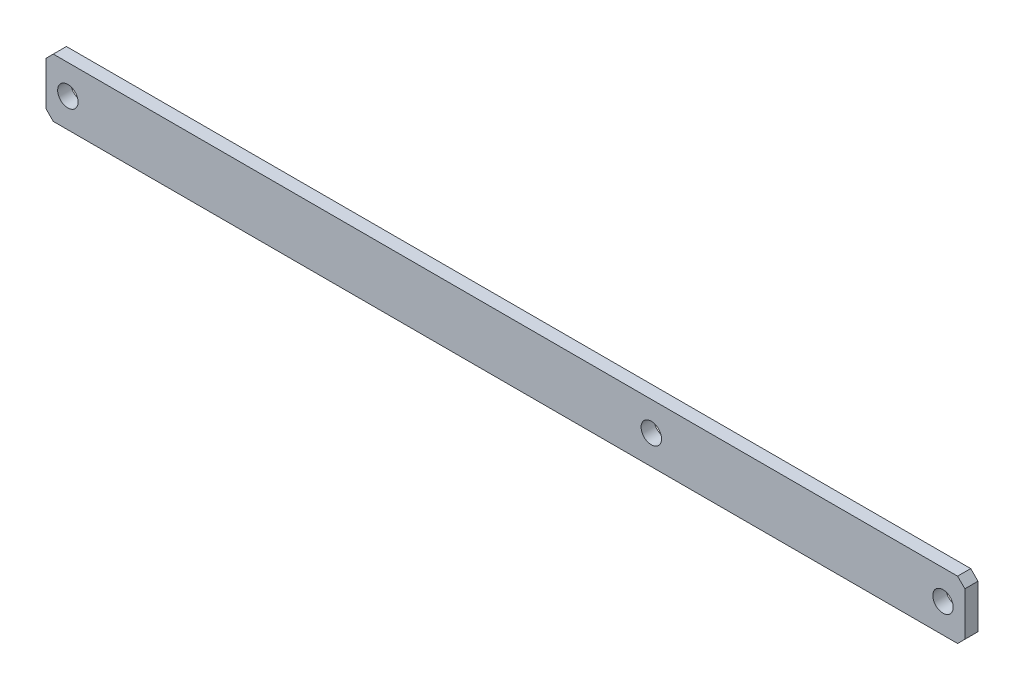
ISO-10303-21;
HEADER;
FILE_DESCRIPTION(('STEP AP214'),'2;1');
FILE_NAME('part.step','',(''),(''),'','','');
FILE_SCHEMA(('AUTOMOTIVE_DESIGN { 1 0 10303 214 1 1 1 1 }'));
ENDSEC;
DATA;
#1=APPLICATION_CONTEXT('core data for automotive mechanical design processes');
#2=APPLICATION_PROTOCOL_DEFINITION('international standard','automotive_design',2000,#1);
#3=PRODUCT_CONTEXT('',#1,'mechanical');
#4=PRODUCT('Part','Part','',(#3));
#5=PRODUCT_RELATED_PRODUCT_CATEGORY('part','',(#4));
#6=PRODUCT_DEFINITION_FORMATION('','',#4);
#7=PRODUCT_DEFINITION_CONTEXT('part definition',#1,'design');
#8=PRODUCT_DEFINITION('design','',#6,#7);
#9=PRODUCT_DEFINITION_SHAPE('','',#8);
#10=(LENGTH_UNIT() NAMED_UNIT(*) SI_UNIT(.MILLI.,.METRE.));
#11=(NAMED_UNIT(*) PLANE_ANGLE_UNIT() SI_UNIT($,.RADIAN.));
#12=(NAMED_UNIT(*) SI_UNIT($,.STERADIAN.) SOLID_ANGLE_UNIT());
#13=UNCERTAINTY_MEASURE_WITH_UNIT(LENGTH_MEASURE(1.E-05),#10,'distance_accuracy_value','');
#14=(GEOMETRIC_REPRESENTATION_CONTEXT(3) GLOBAL_UNCERTAINTY_ASSIGNED_CONTEXT((#13)) GLOBAL_UNIT_ASSIGNED_CONTEXT((#10,
#11,#12)) REPRESENTATION_CONTEXT('',''));
#15=CARTESIAN_POINT('',(0.,0.,0.));
#16=DIRECTION('',(0.,0.,1.));
#17=DIRECTION('',(1.,0.,0.));
#18=AXIS2_PLACEMENT_3D('',#15,#16,#17);
#19=CARTESIAN_POINT('',(0.,0.,9.));
#20=DIRECTION('',(0.,0.,-1.));
#21=DIRECTION('',(-1.,0.,0.));
#22=AXIS2_PLACEMENT_3D('',#19,#20,#21);
#23=PLANE('',#22);
#24=CARTESIAN_POINT('',(200.,0.,9.));
#25=DIRECTION('',(0.,0.,-1.));
#26=DIRECTION('',(-1.,0.,0.));
#27=AXIS2_PLACEMENT_3D('',#24,#25,#26);
#28=CIRCLE('',#27,7.00000000000001);
#29=CARTESIAN_POINT('',(193.,0.,9.));
#30=VERTEX_POINT('',#29);
#31=EDGE_CURVE('E112',#30,#30,#28,.T.);
#32=ORIENTED_EDGE('',*,*,#31,.T.);
#33=EDGE_LOOP('',(#32));
#34=FACE_BOUND('',#33,.T.);
#35=CARTESIAN_POINT('',(0.,0.,9.));
#36=DIRECTION('',(0.,0.,-1.));
#37=DIRECTION('',(-1.,0.,0.));
#38=AXIS2_PLACEMENT_3D('',#35,#36,#37);
#39=CIRCLE('',#38,7.);
#40=CARTESIAN_POINT('',(-7.,0.,9.));
#41=VERTEX_POINT('',#40);
#42=EDGE_CURVE('E18',#41,#41,#39,.T.);
#43=ORIENTED_EDGE('',*,*,#42,.T.);
#44=EDGE_LOOP('',(#43));
#45=FACE_BOUND('',#44,.T.);
#46=CARTESIAN_POINT('',(-400.,0.,9.));
#47=DIRECTION('',(0.,0.,-1.));
#48=DIRECTION('',(-1.,0.,0.));
#49=AXIS2_PLACEMENT_3D('',#46,#47,#48);
#50=CIRCLE('',#49,7.00000000000001);
#51=CARTESIAN_POINT('',(-407.,0.,9.));
#52=VERTEX_POINT('',#51);
#53=EDGE_CURVE('E114',#52,#52,#50,.T.);
#54=ORIENTED_EDGE('',*,*,#53,.T.);
#55=EDGE_LOOP('',(#54));
#56=FACE_BOUND('',#55,.T.);
#57=DIRECTION('',(0.,1.,0.));
#58=VECTOR('',#57,1.);
#59=CARTESIAN_POINT('',(-415.,-15.,9.));
#60=LINE('',#59,#58);
#61=CARTESIAN_POINT('',(-415.,15.,9.));
#62=VERTEX_POINT('',#61);
#63=CARTESIAN_POINT('',(-415.,-15.,9.));
#64=VERTEX_POINT('',#63);
#65=EDGE_CURVE('E118',#62,#64,#60,.F.);
#66=ORIENTED_EDGE('',*,*,#65,.T.);
#67=DIRECTION('',(-0.707106781186552,0.707106781186543,0.));
#68=VECTOR('',#67,1.);
#69=CARTESIAN_POINT('',(-415.,-15.,9.));
#70=LINE('',#69,#68);
#71=CARTESIAN_POINT('',(-410.,-20.,9.));
#72=VERTEX_POINT('',#71);
#73=EDGE_CURVE('E127',#64,#72,#70,.F.);
#74=ORIENTED_EDGE('',*,*,#73,.T.);
#75=DIRECTION('',(1.,0.,0.));
#76=VECTOR('',#75,1.);
#77=CARTESIAN_POINT('',(0.,-20.,9.));
#78=LINE('',#77,#76);
#79=CARTESIAN_POINT('',(210.,-20.,9.));
#80=VERTEX_POINT('',#79);
#81=EDGE_CURVE('E131',#72,#80,#78,.T.);
#82=ORIENTED_EDGE('',*,*,#81,.T.);
#83=DIRECTION('',(-0.707106781186544,-0.707106781186551,0.));
#84=VECTOR('',#83,1.);
#85=CARTESIAN_POINT('',(210.,-20.,9.));
#86=LINE('',#85,#84);
#87=CARTESIAN_POINT('',(215.,-15.,9.));
#88=VERTEX_POINT('',#87);
#89=EDGE_CURVE('E135',#80,#88,#86,.F.);
#90=ORIENTED_EDGE('',*,*,#89,.T.);
#91=DIRECTION('',(0.,1.,0.));
#92=VECTOR('',#91,1.);
#93=CARTESIAN_POINT('',(215.,15.,9.));
#94=LINE('',#93,#92);
#95=CARTESIAN_POINT('',(215.,15.,9.));
#96=VERTEX_POINT('',#95);
#97=EDGE_CURVE('E139',#88,#96,#94,.T.);
#98=ORIENTED_EDGE('',*,*,#97,.T.);
#99=DIRECTION('',(0.707106781186544,-0.707106781186551,0.));
#100=VECTOR('',#99,1.);
#101=CARTESIAN_POINT('',(210.,20.,9.));
#102=LINE('',#101,#100);
#103=CARTESIAN_POINT('',(210.,20.,9.));
#104=VERTEX_POINT('',#103);
#105=EDGE_CURVE('E78',#96,#104,#102,.F.);
#106=ORIENTED_EDGE('',*,*,#105,.T.);
#107=DIRECTION('',(1.,0.,0.));
#108=VECTOR('',#107,1.);
#109=CARTESIAN_POINT('',(-410.,20.,9.));
#110=LINE('',#109,#108);
#111=CARTESIAN_POINT('',(-410.,20.,9.));
#112=VERTEX_POINT('',#111);
#113=EDGE_CURVE('E80',#104,#112,#110,.F.);
#114=ORIENTED_EDGE('',*,*,#113,.T.);
#115=DIRECTION('',(0.707106781186552,0.707106781186543,0.));
#116=VECTOR('',#115,1.);
#117=CARTESIAN_POINT('',(-415.,15.,9.));
#118=LINE('',#117,#116);
#119=EDGE_CURVE('E82',#112,#62,#118,.F.);
#120=ORIENTED_EDGE('',*,*,#119,.T.);
#121=EDGE_LOOP('',(#66,#74,#82,#90,#98,#106,#114,#120));
#122=FACE_BOUND('',#121,.T.);
#123=ADVANCED_FACE('F15',(#34,#45,#56,#122),#23,.F.);
#124=CARTESIAN_POINT('',(0.,0.,9.));
#125=DIRECTION('',(0.,0.,-1.));
#126=DIRECTION('',(-1.,0.,0.));
#127=AXIS2_PLACEMENT_3D('',#124,#125,#126);
#128=CYLINDRICAL_SURFACE('',#127,7.);
#129=ORIENTED_EDGE('',*,*,#42,.F.);
#130=EDGE_LOOP('',(#129));
#131=FACE_BOUND('',#130,.T.);
#132=CARTESIAN_POINT('',(0.,0.,0.));
#133=DIRECTION('',(0.,0.,-1.));
#134=DIRECTION('',(-1.,0.,0.));
#135=AXIS2_PLACEMENT_3D('',#132,#133,#134);
#136=CIRCLE('',#135,7.);
#137=CARTESIAN_POINT('',(-7.,0.,0.));
#138=VERTEX_POINT('',#137);
#139=EDGE_CURVE('E108',#138,#138,#136,.F.);
#140=ORIENTED_EDGE('',*,*,#139,.F.);
#141=EDGE_LOOP('',(#140));
#142=FACE_BOUND('',#141,.T.);
#143=ADVANCED_FACE('F280',(#131,#142),#128,.F.);
#144=CARTESIAN_POINT('',(-415.,15.,9.));
#145=DIRECTION('',(0.707106781186543,-0.707106781186552,0.));
#146=DIRECTION('',(0.707106781186552,0.707106781186543,0.));
#147=AXIS2_PLACEMENT_3D('',#144,#145,#146);
#148=PLANE('',#147);
#149=DIRECTION('',(0.,0.,-1.));
#150=VECTOR('',#149,1.);
#151=CARTESIAN_POINT('',(-415.,15.,9.));
#152=LINE('',#151,#150);
#153=CARTESIAN_POINT('',(-415.,15.,0.));
#154=VERTEX_POINT('',#153);
#155=EDGE_CURVE('E93',#154,#62,#152,.F.);
#156=ORIENTED_EDGE('',*,*,#155,.T.);
#157=ORIENTED_EDGE('',*,*,#119,.F.);
#158=DIRECTION('',(0.,0.,-1.));
#159=VECTOR('',#158,1.);
#160=CARTESIAN_POINT('',(-410.,20.,9.));
#161=LINE('',#160,#159);
#162=CARTESIAN_POINT('',(-410.,20.,0.));
#163=VERTEX_POINT('',#162);
#164=EDGE_CURVE('E87',#112,#163,#161,.T.);
#165=ORIENTED_EDGE('',*,*,#164,.T.);
#166=DIRECTION('',(0.707106781186552,0.707106781186543,0.));
#167=VECTOR('',#166,1.);
#168=CARTESIAN_POINT('',(-415.,15.,0.));
#169=LINE('',#168,#167);
#170=EDGE_CURVE('E111',#154,#163,#169,.T.);
#171=ORIENTED_EDGE('',*,*,#170,.F.);
#172=EDGE_LOOP('',(#156,#157,#165,#171));
#173=FACE_BOUND('',#172,.T.);
#174=ADVANCED_FACE('F90',(#173),#148,.F.);
#175=CARTESIAN_POINT('',(-410.,20.,9.));
#176=DIRECTION('',(0.,-1.,0.));
#177=DIRECTION('',(0.,0.,-1.));
#178=AXIS2_PLACEMENT_3D('',#175,#176,#177);
#179=PLANE('',#178);
#180=ORIENTED_EDGE('',*,*,#164,.F.);
#181=ORIENTED_EDGE('',*,*,#113,.F.);
#182=DIRECTION('',(0.,0.,1.));
#183=VECTOR('',#182,1.);
#184=CARTESIAN_POINT('',(210.,20.,9.));
#185=LINE('',#184,#183);
#186=CARTESIAN_POINT('',(210.,20.,0.));
#187=VERTEX_POINT('',#186);
#188=EDGE_CURVE('E101',#104,#187,#185,.F.);
#189=ORIENTED_EDGE('',*,*,#188,.T.);
#190=DIRECTION('',(-1.,0.,0.));
#191=VECTOR('',#190,1.);
#192=CARTESIAN_POINT('',(0.,20.,0.));
#193=LINE('',#192,#191);
#194=EDGE_CURVE('E98',#163,#187,#193,.F.);
#195=ORIENTED_EDGE('',*,*,#194,.F.);
#196=EDGE_LOOP('',(#180,#181,#189,#195));
#197=FACE_BOUND('',#196,.T.);
#198=ADVANCED_FACE('F96',(#197),#179,.F.);
#199=CARTESIAN_POINT('',(210.,20.,9.));
#200=DIRECTION('',(-0.707106781186551,-0.707106781186544,0.));
#201=DIRECTION('',(0.707106781186544,-0.707106781186551,0.));
#202=AXIS2_PLACEMENT_3D('',#199,#200,#201);
#203=PLANE('',#202);
#204=ORIENTED_EDGE('',*,*,#188,.F.);
#205=ORIENTED_EDGE('',*,*,#105,.F.);
#206=DIRECTION('',(0.,0.,1.));
#207=VECTOR('',#206,1.);
#208=CARTESIAN_POINT('',(215.,15.,9.));
#209=LINE('',#208,#207);
#210=CARTESIAN_POINT('',(215.,15.,0.));
#211=VERTEX_POINT('',#210);
#212=EDGE_CURVE('E137',#96,#211,#209,.F.);
#213=ORIENTED_EDGE('',*,*,#212,.T.);
#214=DIRECTION('',(0.707106781186542,-0.707106781186553,0.));
#215=VECTOR('',#214,1.);
#216=CARTESIAN_POINT('',(210.,20.,0.));
#217=LINE('',#216,#215);
#218=EDGE_CURVE('E143',#187,#211,#217,.T.);
#219=ORIENTED_EDGE('',*,*,#218,.F.);
#220=EDGE_LOOP('',(#204,#205,#213,#219));
#221=FACE_BOUND('',#220,.T.);
#222=ADVANCED_FACE('F144',(#221),#203,.F.);
#223=CARTESIAN_POINT('',(215.,15.,9.));
#224=DIRECTION('',(-1.,0.,0.));
#225=DIRECTION('',(0.,0.,1.));
#226=AXIS2_PLACEMENT_3D('',#223,#224,#225);
#227=PLANE('',#226);
#228=ORIENTED_EDGE('',*,*,#212,.F.);
#229=ORIENTED_EDGE('',*,*,#97,.F.);
#230=DIRECTION('',(0.,0.,1.));
#231=VECTOR('',#230,1.);
#232=CARTESIAN_POINT('',(215.,-15.,9.));
#233=LINE('',#232,#231);
#234=CARTESIAN_POINT('',(215.,-15.,0.));
#235=VERTEX_POINT('',#234);
#236=EDGE_CURVE('E133',#88,#235,#233,.F.);
#237=ORIENTED_EDGE('',*,*,#236,.T.);
#238=DIRECTION('',(0.,1.,0.));
#239=VECTOR('',#238,1.);
#240=CARTESIAN_POINT('',(215.,0.,0.));
#241=LINE('',#240,#239);
#242=EDGE_CURVE('E149',#211,#235,#241,.F.);
#243=ORIENTED_EDGE('',*,*,#242,.F.);
#244=EDGE_LOOP('',(#228,#229,#237,#243));
#245=FACE_BOUND('',#244,.T.);
#246=ADVANCED_FACE('F181',(#245),#227,.F.);
#247=CARTESIAN_POINT('',(210.,-20.,9.));
#248=DIRECTION('',(-0.707106781186551,0.707106781186544,0.));
#249=DIRECTION('',(-0.707106781186544,-0.707106781186551,0.));
#250=AXIS2_PLACEMENT_3D('',#247,#248,#249);
#251=PLANE('',#250);
#252=ORIENTED_EDGE('',*,*,#236,.F.);
#253=ORIENTED_EDGE('',*,*,#89,.F.);
#254=DIRECTION('',(0.,0.,1.));
#255=VECTOR('',#254,1.);
#256=CARTESIAN_POINT('',(210.,-20.,9.));
#257=LINE('',#256,#255);
#258=CARTESIAN_POINT('',(210.,-20.,0.));
#259=VERTEX_POINT('',#258);
#260=EDGE_CURVE('E129',#80,#259,#257,.F.);
#261=ORIENTED_EDGE('',*,*,#260,.T.);
#262=DIRECTION('',(-0.707106781186542,-0.707106781186553,0.));
#263=VECTOR('',#262,1.);
#264=CARTESIAN_POINT('',(215.,-15.,0.));
#265=LINE('',#264,#263);
#266=EDGE_CURVE('E157',#235,#259,#265,.T.);
#267=ORIENTED_EDGE('',*,*,#266,.F.);
#268=EDGE_LOOP('',(#252,#253,#261,#267));
#269=FACE_BOUND('',#268,.T.);
#270=ADVANCED_FACE('F178',(#269),#251,.F.);
#271=CARTESIAN_POINT('',(0.,-20.,9.));
#272=DIRECTION('',(0.,1.,0.));
#273=DIRECTION('',(0.,0.,1.));
#274=AXIS2_PLACEMENT_3D('',#271,#272,#273);
#275=PLANE('',#274);
#276=ORIENTED_EDGE('',*,*,#260,.F.);
#277=ORIENTED_EDGE('',*,*,#81,.F.);
#278=DIRECTION('',(0.,0.,1.));
#279=VECTOR('',#278,1.);
#280=CARTESIAN_POINT('',(-410.,-20.,9.));
#281=LINE('',#280,#279);
#282=CARTESIAN_POINT('',(-410.,-20.,0.));
#283=VERTEX_POINT('',#282);
#284=EDGE_CURVE('E125',#72,#283,#281,.F.);
#285=ORIENTED_EDGE('',*,*,#284,.T.);
#286=DIRECTION('',(-1.,0.,0.));
#287=VECTOR('',#286,1.);
#288=CARTESIAN_POINT('',(0.,-20.,0.));
#289=LINE('',#288,#287);
#290=EDGE_CURVE('E160',#259,#283,#289,.T.);
#291=ORIENTED_EDGE('',*,*,#290,.F.);
#292=EDGE_LOOP('',(#276,#277,#285,#291));
#293=FACE_BOUND('',#292,.T.);
#294=ADVANCED_FACE('F173',(#293),#275,.F.);
#295=CARTESIAN_POINT('',(-415.,-15.,9.));
#296=DIRECTION('',(0.707106781186543,0.707106781186552,0.));
#297=DIRECTION('',(-0.707106781186552,0.707106781186543,0.));
#298=AXIS2_PLACEMENT_3D('',#295,#296,#297);
#299=PLANE('',#298);
#300=ORIENTED_EDGE('',*,*,#284,.F.);
#301=ORIENTED_EDGE('',*,*,#73,.F.);
#302=DIRECTION('',(0.,0.,-1.));
#303=VECTOR('',#302,1.);
#304=CARTESIAN_POINT('',(-415.,-15.,9.));
#305=LINE('',#304,#303);
#306=CARTESIAN_POINT('',(-415.,-15.,0.));
#307=VERTEX_POINT('',#306);
#308=EDGE_CURVE('E33',#64,#307,#305,.T.);
#309=ORIENTED_EDGE('',*,*,#308,.T.);
#310=DIRECTION('',(-0.707106781186552,0.707106781186543,0.));
#311=VECTOR('',#310,1.);
#312=CARTESIAN_POINT('',(-410.,-20.,0.));
#313=LINE('',#312,#311);
#314=EDGE_CURVE('E163',#283,#307,#313,.T.);
#315=ORIENTED_EDGE('',*,*,#314,.F.);
#316=EDGE_LOOP('',(#300,#301,#309,#315));
#317=FACE_BOUND('',#316,.T.);
#318=ADVANCED_FACE('F169',(#317),#299,.F.);
#319=CARTESIAN_POINT('',(-415.,-15.,9.));
#320=DIRECTION('',(1.,0.,0.));
#321=DIRECTION('',(0.,0.,-1.));
#322=AXIS2_PLACEMENT_3D('',#319,#320,#321);
#323=PLANE('',#322);
#324=ORIENTED_EDGE('',*,*,#308,.F.);
#325=ORIENTED_EDGE('',*,*,#65,.F.);
#326=ORIENTED_EDGE('',*,*,#155,.F.);
#327=DIRECTION('',(0.,1.,0.));
#328=VECTOR('',#327,1.);
#329=CARTESIAN_POINT('',(-415.,0.,0.));
#330=LINE('',#329,#328);
#331=EDGE_CURVE('E107',#307,#154,#330,.T.);
#332=ORIENTED_EDGE('',*,*,#331,.F.);
#333=EDGE_LOOP('',(#324,#325,#326,#332));
#334=FACE_BOUND('',#333,.T.);
#335=ADVANCED_FACE('F166',(#334),#323,.F.);
#336=CARTESIAN_POINT('',(-400.,0.,9.));
#337=DIRECTION('',(0.,0.,-1.));
#338=DIRECTION('',(-1.,0.,0.));
#339=AXIS2_PLACEMENT_3D('',#336,#337,#338);
#340=CYLINDRICAL_SURFACE('',#339,7.00000000000001);
#341=ORIENTED_EDGE('',*,*,#53,.F.);
#342=EDGE_LOOP('',(#341));
#343=FACE_BOUND('',#342,.T.);
#344=CARTESIAN_POINT('',(-400.,0.,0.));
#345=DIRECTION('',(0.,0.,-1.));
#346=DIRECTION('',(-1.,0.,0.));
#347=AXIS2_PLACEMENT_3D('',#344,#345,#346);
#348=CIRCLE('',#347,7.00000000000001);
#349=CARTESIAN_POINT('',(-407.,0.,0.));
#350=VERTEX_POINT('',#349);
#351=EDGE_CURVE('E24',#350,#350,#348,.F.);
#352=ORIENTED_EDGE('',*,*,#351,.F.);
#353=EDGE_LOOP('',(#352));
#354=FACE_BOUND('',#353,.T.);
#355=ADVANCED_FACE('F198',(#343,#354),#340,.F.);
#356=CARTESIAN_POINT('',(200.,0.,9.));
#357=DIRECTION('',(0.,0.,-1.));
#358=DIRECTION('',(-1.,0.,0.));
#359=AXIS2_PLACEMENT_3D('',#356,#357,#358);
#360=CYLINDRICAL_SURFACE('',#359,7.00000000000001);
#361=ORIENTED_EDGE('',*,*,#31,.F.);
#362=EDGE_LOOP('',(#361));
#363=FACE_BOUND('',#362,.T.);
#364=CARTESIAN_POINT('',(200.,0.,0.));
#365=DIRECTION('',(0.,0.,-1.));
#366=DIRECTION('',(-1.,0.,0.));
#367=AXIS2_PLACEMENT_3D('',#364,#365,#366);
#368=CIRCLE('',#367,7.00000000000001);
#369=CARTESIAN_POINT('',(193.,0.,0.));
#370=VERTEX_POINT('',#369);
#371=EDGE_CURVE('E10',#370,#370,#368,.F.);
#372=ORIENTED_EDGE('',*,*,#371,.F.);
#373=EDGE_LOOP('',(#372));
#374=FACE_BOUND('',#373,.T.);
#375=ADVANCED_FACE('F192',(#363,#374),#360,.F.);
#376=CARTESIAN_POINT('',(0.,0.,0.));
#377=DIRECTION('',(0.,0.,-1.));
#378=DIRECTION('',(-1.,0.,0.));
#379=AXIS2_PLACEMENT_3D('',#376,#377,#378);
#380=PLANE('',#379);
#381=ORIENTED_EDGE('',*,*,#371,.T.);
#382=EDGE_LOOP('',(#381));
#383=FACE_BOUND('',#382,.T.);
#384=ORIENTED_EDGE('',*,*,#351,.T.);
#385=EDGE_LOOP('',(#384));
#386=FACE_BOUND('',#385,.T.);
#387=ORIENTED_EDGE('',*,*,#314,.T.);
#388=ORIENTED_EDGE('',*,*,#331,.T.);
#389=ORIENTED_EDGE('',*,*,#170,.T.);
#390=ORIENTED_EDGE('',*,*,#194,.T.);
#391=ORIENTED_EDGE('',*,*,#218,.T.);
#392=ORIENTED_EDGE('',*,*,#242,.T.);
#393=ORIENTED_EDGE('',*,*,#266,.T.);
#394=ORIENTED_EDGE('',*,*,#290,.T.);
#395=EDGE_LOOP('',(#387,#388,#389,#390,#391,#392,#393,#394));
#396=FACE_BOUND('',#395,.T.);
#397=ORIENTED_EDGE('',*,*,#139,.T.);
#398=EDGE_LOOP('',(#397));
#399=FACE_BOUND('',#398,.T.);
#400=ADVANCED_FACE('F152',(#383,#386,#396,#399),#380,.T.);
#401=CLOSED_SHELL('',(#123,#143,#174,#198,#222,#246,#270,#294,#318,#335,#355,#375,#400));
#402=MANIFOLD_SOLID_BREP('B1',#401);
#403=ADVANCED_BREP_SHAPE_REPRESENTATION('',(#18,#402),#14);
#404=SHAPE_DEFINITION_REPRESENTATION(#9,#403);
ENDSEC;
END-ISO-10303-21;
